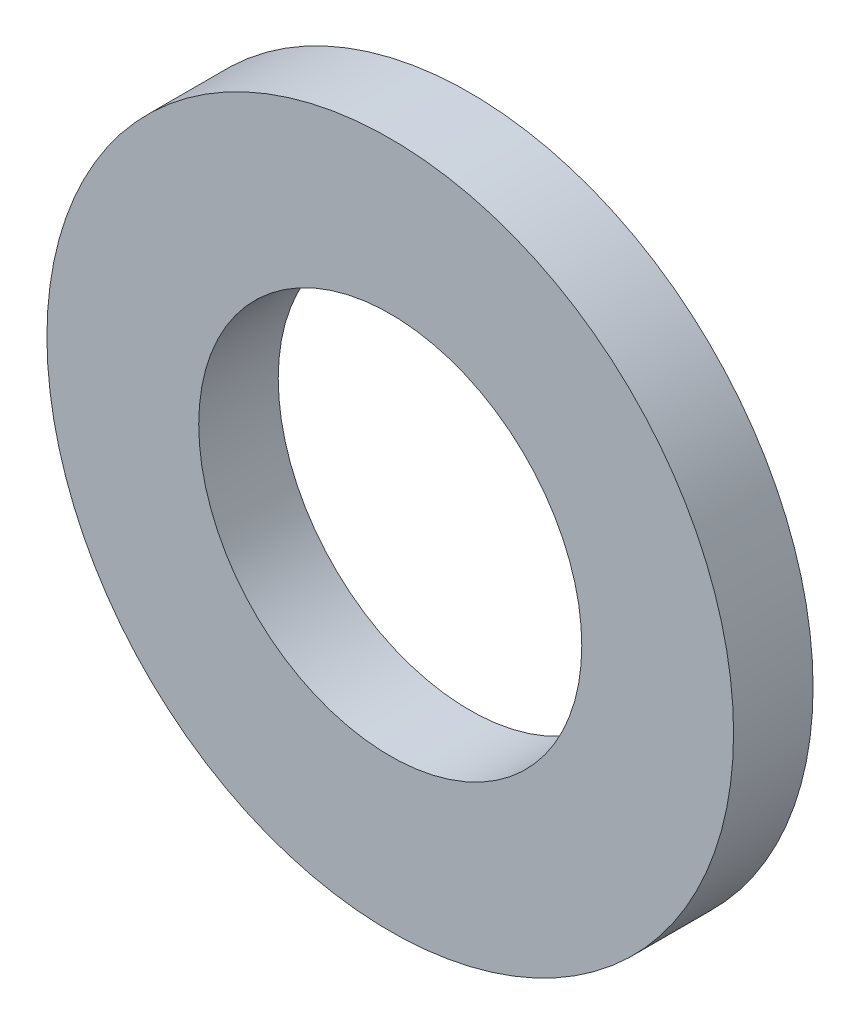
ISO-10303-21;
HEADER;
FILE_DESCRIPTION(('STEP AP214'),'2;1');
FILE_NAME('part.step','',(''),(''),'','','');
FILE_SCHEMA(('AUTOMOTIVE_DESIGN { 1 0 10303 214 1 1 1 1 }'));
ENDSEC;
DATA;
#1=APPLICATION_CONTEXT('core data for automotive mechanical design processes');
#2=APPLICATION_PROTOCOL_DEFINITION('international standard','automotive_design',2000,#1);
#3=PRODUCT_CONTEXT('',#1,'mechanical');
#4=PRODUCT('Part','Part','',(#3));
#5=PRODUCT_RELATED_PRODUCT_CATEGORY('part','',(#4));
#6=PRODUCT_DEFINITION_FORMATION('','',#4);
#7=PRODUCT_DEFINITION_CONTEXT('part definition',#1,'design');
#8=PRODUCT_DEFINITION('design','',#6,#7);
#9=PRODUCT_DEFINITION_SHAPE('','',#8);
#10=(LENGTH_UNIT() NAMED_UNIT(*) SI_UNIT(.MILLI.,.METRE.));
#11=(NAMED_UNIT(*) PLANE_ANGLE_UNIT() SI_UNIT($,.RADIAN.));
#12=(NAMED_UNIT(*) SI_UNIT($,.STERADIAN.) SOLID_ANGLE_UNIT());
#13=UNCERTAINTY_MEASURE_WITH_UNIT(LENGTH_MEASURE(1.E-05),#10,'distance_accuracy_value','');
#14=(GEOMETRIC_REPRESENTATION_CONTEXT(3) GLOBAL_UNCERTAINTY_ASSIGNED_CONTEXT((#13)) GLOBAL_UNIT_ASSIGNED_CONTEXT((#10,
#11,#12)) REPRESENTATION_CONTEXT('',''));
#15=CARTESIAN_POINT('',(0.,0.,0.));
#16=DIRECTION('',(0.,0.,1.));
#17=DIRECTION('',(1.,0.,0.));
#18=AXIS2_PLACEMENT_3D('',#15,#16,#17);
#19=CARTESIAN_POINT('',(0.,0.,1.1));
#20=DIRECTION('',(0.,0.,1.));
#21=DIRECTION('',(1.,0.,0.));
#22=AXIS2_PLACEMENT_3D('',#19,#20,#21);
#23=PLANE('',#22);
#24=CARTESIAN_POINT('',(0.,0.,1.1));
#25=DIRECTION('',(0.,0.,1.));
#26=DIRECTION('',(1.,0.,0.));
#27=AXIS2_PLACEMENT_3D('',#24,#25,#26);
#28=CIRCLE('',#27,4.75);
#29=CARTESIAN_POINT('',(4.75,0.,1.1));
#30=VERTEX_POINT('',#29);
#31=EDGE_CURVE('E12',#30,#30,#28,.T.);
#32=ORIENTED_EDGE('',*,*,#31,.T.);
#33=EDGE_LOOP('',(#32));
#34=FACE_BOUND('',#33,.T.);
#35=CARTESIAN_POINT('',(0.,0.,1.1));
#36=DIRECTION('',(0.,0.,1.));
#37=DIRECTION('',(1.,0.,0.));
#38=AXIS2_PLACEMENT_3D('',#35,#36,#37);
#39=CIRCLE('',#38,2.65);
#40=CARTESIAN_POINT('',(2.65,0.,1.1));
#41=VERTEX_POINT('',#40);
#42=EDGE_CURVE('E54',#41,#41,#39,.T.);
#43=ORIENTED_EDGE('',*,*,#42,.F.);
#44=EDGE_LOOP('',(#43));
#45=FACE_BOUND('',#44,.T.);
#46=ADVANCED_FACE('F43',(#34,#45),#23,.T.);
#47=CARTESIAN_POINT('',(0.,0.,0.));
#48=DIRECTION('',(0.,0.,1.));
#49=DIRECTION('',(1.,0.,0.));
#50=AXIS2_PLACEMENT_3D('',#47,#48,#49);
#51=PLANE('',#50);
#52=CARTESIAN_POINT('',(0.,0.,0.));
#53=DIRECTION('',(0.,0.,1.));
#54=DIRECTION('',(1.,0.,0.));
#55=AXIS2_PLACEMENT_3D('',#52,#53,#54);
#56=CIRCLE('',#55,4.75);
#57=CARTESIAN_POINT('',(4.75,0.,0.));
#58=VERTEX_POINT('',#57);
#59=EDGE_CURVE('E47',#58,#58,#56,.T.);
#60=ORIENTED_EDGE('',*,*,#59,.F.);
#61=EDGE_LOOP('',(#60));
#62=FACE_BOUND('',#61,.T.);
#63=CARTESIAN_POINT('',(0.,0.,0.));
#64=DIRECTION('',(0.,0.,1.));
#65=DIRECTION('',(1.,0.,0.));
#66=AXIS2_PLACEMENT_3D('',#63,#64,#65);
#67=CIRCLE('',#66,2.65);
#68=CARTESIAN_POINT('',(2.65,0.,0.));
#69=VERTEX_POINT('',#68);
#70=EDGE_CURVE('E56',#69,#69,#67,.T.);
#71=ORIENTED_EDGE('',*,*,#70,.T.);
#72=EDGE_LOOP('',(#71));
#73=FACE_BOUND('',#72,.T.);
#74=ADVANCED_FACE('F66',(#62,#73),#51,.F.);
#75=CARTESIAN_POINT('',(0.,0.,1.1));
#76=DIRECTION('',(0.,0.,-1.));
#77=DIRECTION('',(-1.,0.,0.));
#78=AXIS2_PLACEMENT_3D('',#75,#76,#77);
#79=CYLINDRICAL_SURFACE('',#78,4.75);
#80=ORIENTED_EDGE('',*,*,#31,.F.);
#81=EDGE_LOOP('',(#80));
#82=FACE_BOUND('',#81,.T.);
#83=ORIENTED_EDGE('',*,*,#59,.T.);
#84=EDGE_LOOP('',(#83));
#85=FACE_BOUND('',#84,.T.);
#86=ADVANCED_FACE('F45',(#82,#85),#79,.T.);
#87=CARTESIAN_POINT('',(0.,0.,1.1));
#88=DIRECTION('',(0.,0.,-1.));
#89=DIRECTION('',(-1.,0.,0.));
#90=AXIS2_PLACEMENT_3D('',#87,#88,#89);
#91=CYLINDRICAL_SURFACE('',#90,2.65);
#92=ORIENTED_EDGE('',*,*,#42,.T.);
#93=EDGE_LOOP('',(#92));
#94=FACE_BOUND('',#93,.T.);
#95=ORIENTED_EDGE('',*,*,#70,.F.);
#96=EDGE_LOOP('',(#95));
#97=FACE_BOUND('',#96,.T.);
#98=ADVANCED_FACE('F62',(#94,#97),#91,.F.);
#99=CLOSED_SHELL('',(#46,#74,#86,#98));
#100=MANIFOLD_SOLID_BREP('B2',#99);
#101=ADVANCED_BREP_SHAPE_REPRESENTATION('',(#18,#100),#14);
#102=SHAPE_DEFINITION_REPRESENTATION(#9,#101);
ENDSEC;
END-ISO-10303-21;
